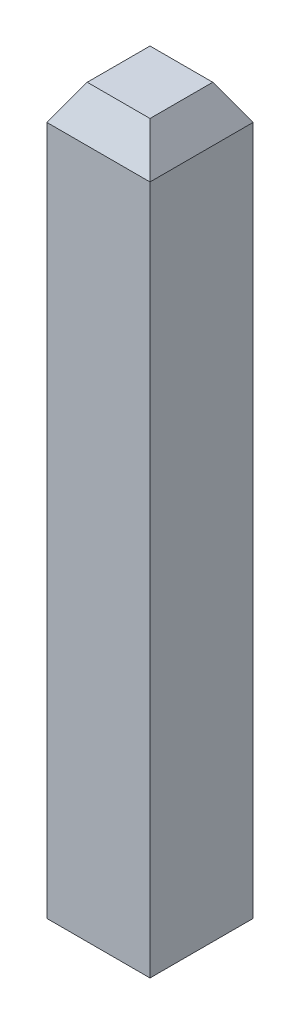
ISO-10303-21;
HEADER;
FILE_DESCRIPTION(('STEP AP214'),'2;1');
FILE_NAME('part.step','',(''),(''),'','','');
FILE_SCHEMA(('AUTOMOTIVE_DESIGN { 1 0 10303 214 1 1 1 1 }'));
ENDSEC;
DATA;
#1=APPLICATION_CONTEXT('core data for automotive mechanical design processes');
#2=APPLICATION_PROTOCOL_DEFINITION('international standard','automotive_design',2000,#1);
#3=PRODUCT_CONTEXT('',#1,'mechanical');
#4=PRODUCT('Part','Part','',(#3));
#5=PRODUCT_RELATED_PRODUCT_CATEGORY('part','',(#4));
#6=PRODUCT_DEFINITION_FORMATION('','',#4);
#7=PRODUCT_DEFINITION_CONTEXT('part definition',#1,'design');
#8=PRODUCT_DEFINITION('design','',#6,#7);
#9=PRODUCT_DEFINITION_SHAPE('','',#8);
#10=(LENGTH_UNIT() NAMED_UNIT(*) SI_UNIT(.MILLI.,.METRE.));
#11=(NAMED_UNIT(*) PLANE_ANGLE_UNIT() SI_UNIT($,.RADIAN.));
#12=(NAMED_UNIT(*) SI_UNIT($,.STERADIAN.) SOLID_ANGLE_UNIT());
#13=UNCERTAINTY_MEASURE_WITH_UNIT(LENGTH_MEASURE(1.E-05),#10,'distance_accuracy_value','');
#14=(GEOMETRIC_REPRESENTATION_CONTEXT(3) GLOBAL_UNCERTAINTY_ASSIGNED_CONTEXT((#13)) GLOBAL_UNIT_ASSIGNED_CONTEXT((#10,
#11,#12)) REPRESENTATION_CONTEXT('',''));
#15=CARTESIAN_POINT('',(0.,0.,0.));
#16=DIRECTION('',(0.,0.,1.));
#17=DIRECTION('',(1.,0.,0.));
#18=AXIS2_PLACEMENT_3D('',#15,#16,#17);
#19=CARTESIAN_POINT('',(-0.93,6.8,0.18));
#20=DIRECTION('',(-1.,0.,0.));
#21=DIRECTION('',(0.,0.,1.));
#22=AXIS2_PLACEMENT_3D('',#19,#20,#21);
#23=PLANE('',#22);
#24=DIRECTION('',(0.,-1.,0.));
#25=VECTOR('',#24,1.);
#26=CARTESIAN_POINT('',(-0.93,6.8,0.18));
#27=LINE('',#26,#25);
#28=CARTESIAN_POINT('',(-0.93,6.58349364905389,0.18));
#29=VERTEX_POINT('',#28);
#30=CARTESIAN_POINT('',(-0.93,2.3,0.18));
#31=VERTEX_POINT('',#30);
#32=EDGE_CURVE('E11',#29,#31,#27,.T.);
#33=ORIENTED_EDGE('',*,*,#32,.F.);
#34=DIRECTION('',(0.,0.,1.));
#35=VECTOR('',#34,1.);
#36=CARTESIAN_POINT('',(-0.93,6.58349364905389,0.18));
#37=LINE('',#36,#35);
#38=CARTESIAN_POINT('',(-0.93,6.58349364905389,0.82));
#39=VERTEX_POINT('',#38);
#40=EDGE_CURVE('E24',#29,#39,#37,.T.);
#41=ORIENTED_EDGE('',*,*,#40,.T.);
#42=DIRECTION('',(0.,-1.,0.));
#43=VECTOR('',#42,1.);
#44=CARTESIAN_POINT('',(-0.93,6.8,0.82));
#45=LINE('',#44,#43);
#46=CARTESIAN_POINT('',(-0.93,2.3,0.82));
#47=VERTEX_POINT('',#46);
#48=EDGE_CURVE('E117',#39,#47,#45,.T.);
#49=ORIENTED_EDGE('',*,*,#48,.T.);
#50=DIRECTION('',(0.,0.,-1.));
#51=VECTOR('',#50,1.);
#52=CARTESIAN_POINT('',(-0.93,2.3,0.18));
#53=LINE('',#52,#51);
#54=EDGE_CURVE('E115',#47,#31,#53,.T.);
#55=ORIENTED_EDGE('',*,*,#54,.T.);
#56=EDGE_LOOP('',(#33,#41,#49,#55));
#57=FACE_BOUND('',#56,.T.);
#58=ADVANCED_FACE('F17',(#57),#23,.F.);
#59=CARTESIAN_POINT('',(-1.57,6.8,0.18));
#60=DIRECTION('',(0.,0.,1.));
#61=DIRECTION('',(1.,0.,0.));
#62=AXIS2_PLACEMENT_3D('',#59,#60,#61);
#63=PLANE('',#62);
#64=DIRECTION('',(0.,-1.,0.));
#65=VECTOR('',#64,1.);
#66=CARTESIAN_POINT('',(-1.57,6.8,0.18));
#67=LINE('',#66,#65);
#68=CARTESIAN_POINT('',(-1.57,6.58349364905389,0.18));
#69=VERTEX_POINT('',#68);
#70=CARTESIAN_POINT('',(-1.57,2.3,0.18));
#71=VERTEX_POINT('',#70);
#72=EDGE_CURVE('E113',#69,#71,#67,.T.);
#73=ORIENTED_EDGE('',*,*,#72,.F.);
#74=DIRECTION('',(1.,0.,0.));
#75=VECTOR('',#74,1.);
#76=CARTESIAN_POINT('',(-1.57,6.58349364905389,0.18));
#77=LINE('',#76,#75);
#78=EDGE_CURVE('E111',#69,#29,#77,.T.);
#79=ORIENTED_EDGE('',*,*,#78,.T.);
#80=ORIENTED_EDGE('',*,*,#32,.T.);
#81=DIRECTION('',(-1.,0.,0.));
#82=VECTOR('',#81,1.);
#83=CARTESIAN_POINT('',(-1.57,2.3,0.18));
#84=LINE('',#83,#82);
#85=EDGE_CURVE('E109',#31,#71,#84,.T.);
#86=ORIENTED_EDGE('',*,*,#85,.T.);
#87=EDGE_LOOP('',(#73,#79,#80,#86));
#88=FACE_BOUND('',#87,.T.);
#89=ADVANCED_FACE('F139',(#88),#63,.F.);
#90=CARTESIAN_POINT('',(-1.57,6.8,0.82));
#91=DIRECTION('',(1.,0.,0.));
#92=DIRECTION('',(0.,0.,-1.));
#93=AXIS2_PLACEMENT_3D('',#90,#91,#92);
#94=PLANE('',#93);
#95=DIRECTION('',(0.,-1.,0.));
#96=VECTOR('',#95,1.);
#97=CARTESIAN_POINT('',(-1.57,6.8,0.82));
#98=LINE('',#97,#96);
#99=CARTESIAN_POINT('',(-1.57,6.58349364905389,0.82));
#100=VERTEX_POINT('',#99);
#101=CARTESIAN_POINT('',(-1.57,2.3,0.82));
#102=VERTEX_POINT('',#101);
#103=EDGE_CURVE('E107',#100,#102,#98,.T.);
#104=ORIENTED_EDGE('',*,*,#103,.F.);
#105=DIRECTION('',(0.,0.,-1.));
#106=VECTOR('',#105,1.);
#107=CARTESIAN_POINT('',(-1.57,6.58349364905389,0.82));
#108=LINE('',#107,#106);
#109=EDGE_CURVE('E104',#100,#69,#108,.T.);
#110=ORIENTED_EDGE('',*,*,#109,.T.);
#111=ORIENTED_EDGE('',*,*,#72,.T.);
#112=DIRECTION('',(0.,0.,1.));
#113=VECTOR('',#112,1.);
#114=CARTESIAN_POINT('',(-1.57,2.3,0.82));
#115=LINE('',#114,#113);
#116=EDGE_CURVE('E101',#71,#102,#115,.T.);
#117=ORIENTED_EDGE('',*,*,#116,.T.);
#118=EDGE_LOOP('',(#104,#110,#111,#117));
#119=FACE_BOUND('',#118,.T.);
#120=ADVANCED_FACE('F134',(#119),#94,.F.);
#121=CARTESIAN_POINT('',(-0.93,6.8,0.82));
#122=DIRECTION('',(0.,0.,-1.));
#123=DIRECTION('',(-1.,0.,0.));
#124=AXIS2_PLACEMENT_3D('',#121,#122,#123);
#125=PLANE('',#124);
#126=ORIENTED_EDGE('',*,*,#48,.F.);
#127=DIRECTION('',(-1.,0.,0.));
#128=VECTOR('',#127,1.);
#129=CARTESIAN_POINT('',(-0.93,6.58349364905389,0.82));
#130=LINE('',#129,#128);
#131=EDGE_CURVE('E98',#39,#100,#130,.T.);
#132=ORIENTED_EDGE('',*,*,#131,.T.);
#133=ORIENTED_EDGE('',*,*,#103,.T.);
#134=DIRECTION('',(1.,0.,0.));
#135=VECTOR('',#134,1.);
#136=CARTESIAN_POINT('',(-0.93,2.3,0.82));
#137=LINE('',#136,#135);
#138=EDGE_CURVE('E95',#102,#47,#137,.T.);
#139=ORIENTED_EDGE('',*,*,#138,.T.);
#140=EDGE_LOOP('',(#126,#132,#133,#139));
#141=FACE_BOUND('',#140,.T.);
#142=ADVANCED_FACE('F122',(#141),#125,.F.);
#143=CARTESIAN_POINT('',(0.,6.8,0.));
#144=DIRECTION('',(0.,-1.,0.));
#145=DIRECTION('',(0.,0.,-1.));
#146=AXIS2_PLACEMENT_3D('',#143,#144,#145);
#147=PLANE('',#146);
#148=DIRECTION('',(0.,0.,1.));
#149=VECTOR('',#148,1.);
#150=CARTESIAN_POINT('',(-1.445,6.8,0.));
#151=LINE('',#150,#149);
#152=CARTESIAN_POINT('',(-1.445,6.8,0.305));
#153=VERTEX_POINT('',#152);
#154=CARTESIAN_POINT('',(-1.445,6.8,0.695));
#155=VERTEX_POINT('',#154);
#156=EDGE_CURVE('E93',#153,#155,#151,.T.);
#157=ORIENTED_EDGE('',*,*,#156,.T.);
#158=DIRECTION('',(1.,0.,0.));
#159=VECTOR('',#158,1.);
#160=CARTESIAN_POINT('',(0.,6.8,0.694999999999999));
#161=LINE('',#160,#159);
#162=CARTESIAN_POINT('',(-1.055,6.8,0.694999999999999));
#163=VERTEX_POINT('',#162);
#164=EDGE_CURVE('E72',#155,#163,#161,.T.);
#165=ORIENTED_EDGE('',*,*,#164,.T.);
#166=DIRECTION('',(0.,0.,-1.));
#167=VECTOR('',#166,1.);
#168=CARTESIAN_POINT('',(-1.055,6.8,0.));
#169=LINE('',#168,#167);
#170=CARTESIAN_POINT('',(-1.055,6.8,0.305));
#171=VERTEX_POINT('',#170);
#172=EDGE_CURVE('E66',#163,#171,#169,.T.);
#173=ORIENTED_EDGE('',*,*,#172,.T.);
#174=DIRECTION('',(-1.,0.,0.));
#175=VECTOR('',#174,1.);
#176=CARTESIAN_POINT('',(0.,6.8,0.305));
#177=LINE('',#176,#175);
#178=EDGE_CURVE('E69',#171,#153,#177,.T.);
#179=ORIENTED_EDGE('',*,*,#178,.T.);
#180=EDGE_LOOP('',(#157,#165,#173,#179));
#181=FACE_BOUND('',#180,.T.);
#182=ADVANCED_FACE('F68',(#181),#147,.F.);
#183=CARTESIAN_POINT('',(0.,2.3,0.));
#184=DIRECTION('',(0.,-1.,0.));
#185=DIRECTION('',(0.,0.,-1.));
#186=AXIS2_PLACEMENT_3D('',#183,#184,#185);
#187=PLANE('',#186);
#188=ORIENTED_EDGE('',*,*,#54,.F.);
#189=ORIENTED_EDGE('',*,*,#138,.F.);
#190=ORIENTED_EDGE('',*,*,#116,.F.);
#191=ORIENTED_EDGE('',*,*,#85,.F.);
#192=EDGE_LOOP('',(#188,#189,#190,#191));
#193=FACE_BOUND('',#192,.T.);
#194=ADVANCED_FACE('F138',(#193),#187,.T.);
#195=CARTESIAN_POINT('',(0.,6.8,0.305));
#196=DIRECTION('',(0.,-0.500000000000004,0.866025403784436));
#197=DIRECTION('',(-1.,0.,0.));
#198=AXIS2_PLACEMENT_3D('',#195,#196,#197);
#199=PLANE('',#198);
#200=DIRECTION('',(-0.447213595499961,0.77459666924148,0.447213595499961));
#201=VECTOR('',#200,1.);
#202=CARTESIAN_POINT('',(-0.994,6.6943449007383,0.244));
#203=LINE('',#202,#201);
#204=EDGE_CURVE('E82',#29,#171,#203,.T.);
#205=ORIENTED_EDGE('',*,*,#204,.F.);
#206=ORIENTED_EDGE('',*,*,#78,.F.);
#207=DIRECTION('',(-0.447213595499961,-0.77459666924148,-0.447213595499961));
#208=VECTOR('',#207,1.);
#209=CARTESIAN_POINT('',(-1.156,7.3005626833874,0.594000000000004));
#210=LINE('',#209,#208);
#211=EDGE_CURVE('E84',#153,#69,#210,.T.);
#212=ORIENTED_EDGE('',*,*,#211,.F.);
#213=ORIENTED_EDGE('',*,*,#178,.F.);
#214=EDGE_LOOP('',(#205,#206,#212,#213));
#215=FACE_BOUND('',#214,.T.);
#216=ADVANCED_FACE('F80',(#215),#199,.F.);
#217=CARTESIAN_POINT('',(-1.445,6.8,0.));
#218=DIRECTION('',(0.866025403784436,-0.500000000000004,0.));
#219=DIRECTION('',(0.,0.,1.));
#220=AXIS2_PLACEMENT_3D('',#217,#218,#219);
#221=PLANE('',#220);
#222=ORIENTED_EDGE('',*,*,#211,.T.);
#223=ORIENTED_EDGE('',*,*,#109,.F.);
#224=DIRECTION('',(-0.447213595499961,-0.77459666924148,0.447213595499961));
#225=VECTOR('',#224,1.);
#226=CARTESIAN_POINT('',(-1.306,7.04075506225207,0.555999999999998));
#227=LINE('',#226,#225);
#228=EDGE_CURVE('E88',#155,#100,#227,.T.);
#229=ORIENTED_EDGE('',*,*,#228,.F.);
#230=ORIENTED_EDGE('',*,*,#156,.F.);
#231=EDGE_LOOP('',(#222,#223,#229,#230));
#232=FACE_BOUND('',#231,.T.);
#233=ADVANCED_FACE('F132',(#232),#221,.F.);
#234=CARTESIAN_POINT('',(-1.055,6.8,0.));
#235=DIRECTION('',(-0.866025403784436,-0.500000000000004,0.));
#236=DIRECTION('',(0.,0.,-1.));
#237=AXIS2_PLACEMENT_3D('',#234,#235,#236);
#238=PLANE('',#237);
#239=ORIENTED_EDGE('',*,*,#204,.T.);
#240=ORIENTED_EDGE('',*,*,#172,.F.);
#241=DIRECTION('',(-0.447213595499961,0.77459666924148,-0.447213595499961));
#242=VECTOR('',#241,1.);
#243=CARTESIAN_POINT('',(-1.194,7.04075506225207,0.555999999999998));
#244=LINE('',#243,#242);
#245=EDGE_CURVE('E127',#39,#163,#244,.T.);
#246=ORIENTED_EDGE('',*,*,#245,.F.);
#247=ORIENTED_EDGE('',*,*,#40,.F.);
#248=EDGE_LOOP('',(#239,#240,#246,#247));
#249=FACE_BOUND('',#248,.T.);
#250=ADVANCED_FACE('F86',(#249),#238,.F.);
#251=CARTESIAN_POINT('',(0.,6.8,0.694999999999999));
#252=DIRECTION('',(0.,-0.500000000000004,-0.866025403784436));
#253=DIRECTION('',(1.,0.,0.));
#254=AXIS2_PLACEMENT_3D('',#251,#252,#253);
#255=PLANE('',#254);
#256=ORIENTED_EDGE('',*,*,#228,.T.);
#257=ORIENTED_EDGE('',*,*,#131,.F.);
#258=ORIENTED_EDGE('',*,*,#245,.T.);
#259=ORIENTED_EDGE('',*,*,#164,.F.);
#260=EDGE_LOOP('',(#256,#257,#258,#259));
#261=FACE_BOUND('',#260,.T.);
#262=ADVANCED_FACE('F126',(#261),#255,.F.);
#263=CLOSED_SHELL('',(#58,#89,#120,#142,#182,#194,#216,#233,#250,#262));
#264=MANIFOLD_SOLID_BREP('B1',#263);
#265=ADVANCED_BREP_SHAPE_REPRESENTATION('',(#18,#264),#14);
#266=SHAPE_DEFINITION_REPRESENTATION(#9,#265);
ENDSEC;
END-ISO-10303-21;
